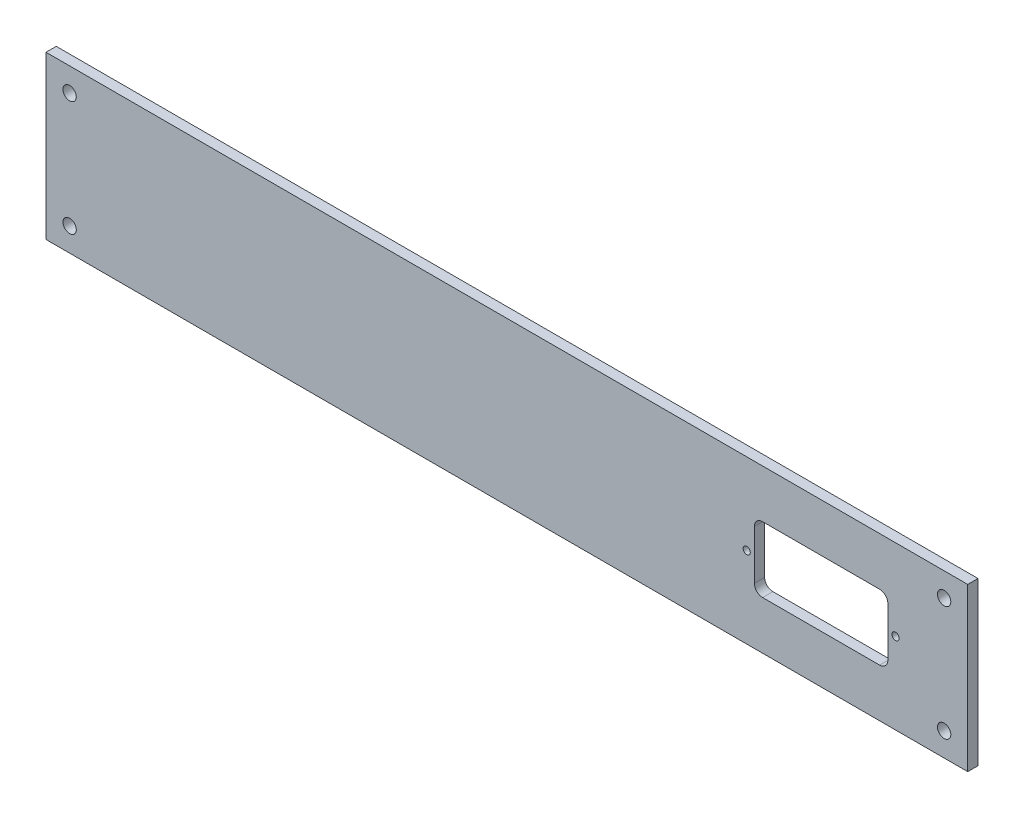
ISO-10303-21;
HEADER;
FILE_DESCRIPTION(('STEP AP214'),'2;1');
FILE_NAME('part.step','',(''),(''),'','','');
FILE_SCHEMA(('AUTOMOTIVE_DESIGN { 1 0 10303 214 1 1 1 1 }'));
ENDSEC;
DATA;
#1=APPLICATION_CONTEXT('core data for automotive mechanical design processes');
#2=APPLICATION_PROTOCOL_DEFINITION('international standard','automotive_design',2000,#1);
#3=PRODUCT_CONTEXT('',#1,'mechanical');
#4=PRODUCT('Part','Part','',(#3));
#5=PRODUCT_RELATED_PRODUCT_CATEGORY('part','',(#4));
#6=PRODUCT_DEFINITION_FORMATION('','',#4);
#7=PRODUCT_DEFINITION_CONTEXT('part definition',#1,'design');
#8=PRODUCT_DEFINITION('design','',#6,#7);
#9=PRODUCT_DEFINITION_SHAPE('','',#8);
#10=(LENGTH_UNIT() NAMED_UNIT(*) SI_UNIT(.MILLI.,.METRE.));
#11=(NAMED_UNIT(*) PLANE_ANGLE_UNIT() SI_UNIT($,.RADIAN.));
#12=(NAMED_UNIT(*) SI_UNIT($,.STERADIAN.) SOLID_ANGLE_UNIT());
#13=UNCERTAINTY_MEASURE_WITH_UNIT(LENGTH_MEASURE(1.E-05),#10,'distance_accuracy_value','');
#14=(GEOMETRIC_REPRESENTATION_CONTEXT(3) GLOBAL_UNCERTAINTY_ASSIGNED_CONTEXT((#13)) GLOBAL_UNIT_ASSIGNED_CONTEXT((#10,
#11,#12)) REPRESENTATION_CONTEXT('',''));
#15=CARTESIAN_POINT('',(0.,0.,0.));
#16=DIRECTION('',(0.,0.,1.));
#17=DIRECTION('',(1.,0.,0.));
#18=AXIS2_PLACEMENT_3D('',#15,#16,#17);
#19=CARTESIAN_POINT('',(0.,0.,5.));
#20=DIRECTION('',(0.,0.,-1.));
#21=DIRECTION('',(-1.,0.,0.));
#22=AXIS2_PLACEMENT_3D('',#19,#20,#21);
#23=PLANE('',#22);
#24=CARTESIAN_POINT('',(413.824633799864,39.5055064167184,5.));
#25=DIRECTION('',(0.,0.,-1.));
#26=DIRECTION('',(-1.,0.,0.));
#27=AXIS2_PLACEMENT_3D('',#24,#25,#26);
#28=CIRCLE('',#27,1.74999999999998);
#29=CARTESIAN_POINT('',(412.074633799864,39.5055064167184,5.));
#30=VERTEX_POINT('',#29);
#31=EDGE_CURVE('E181',#30,#30,#28,.T.);
#32=ORIENTED_EDGE('',*,*,#31,.T.);
#33=EDGE_LOOP('',(#32));
#34=FACE_BOUND('',#33,.T.);
#35=DIRECTION('',(0.,1.,0.));
#36=VECTOR('',#35,1.);
#37=CARTESIAN_POINT('',(345.074633799864,51.5,5.));
#38=LINE('',#37,#36);
#39=CARTESIAN_POINT('',(345.074633799864,27.5,5.));
#40=VERTEX_POINT('',#39);
#41=CARTESIAN_POINT('',(345.074633799864,51.5,5.));
#42=VERTEX_POINT('',#41);
#43=EDGE_CURVE('E144',#40,#42,#38,.T.);
#44=ORIENTED_EDGE('',*,*,#43,.T.);
#45=CARTESIAN_POINT('',(349.074633799864,51.5,5.));
#46=DIRECTION('',(0.,0.,-1.));
#47=DIRECTION('',(-1.,0.,0.));
#48=AXIS2_PLACEMENT_3D('',#45,#46,#47);
#49=CIRCLE('',#48,4.);
#50=CARTESIAN_POINT('',(349.074633799864,55.5,5.));
#51=VERTEX_POINT('',#50);
#52=EDGE_CURVE('E138',#42,#51,#49,.T.);
#53=ORIENTED_EDGE('',*,*,#52,.T.);
#54=DIRECTION('',(1.,0.,0.));
#55=VECTOR('',#54,1.);
#56=CARTESIAN_POINT('',(349.074633799864,55.5,5.));
#57=LINE('',#56,#55);
#58=CARTESIAN_POINT('',(406.074633799864,55.5,5.));
#59=VERTEX_POINT('',#58);
#60=EDGE_CURVE('E147',#51,#59,#57,.T.);
#61=ORIENTED_EDGE('',*,*,#60,.T.);
#62=CARTESIAN_POINT('',(406.074633799864,51.4999999999999,5.));
#63=DIRECTION('',(0.,0.,-1.));
#64=DIRECTION('',(1.,0.,0.));
#65=AXIS2_PLACEMENT_3D('',#62,#63,#64);
#66=CIRCLE('',#65,4.00000000000001);
#67=CARTESIAN_POINT('',(410.074633799864,51.4999999999999,5.));
#68=VERTEX_POINT('',#67);
#69=EDGE_CURVE('E60',#59,#68,#66,.T.);
#70=ORIENTED_EDGE('',*,*,#69,.T.);
#71=DIRECTION('',(0.,-1.,0.));
#72=VECTOR('',#71,1.);
#73=CARTESIAN_POINT('',(410.074633799864,51.4999999999999,5.));
#74=LINE('',#73,#72);
#75=CARTESIAN_POINT('',(410.074633799864,27.4999999999999,5.));
#76=VERTEX_POINT('',#75);
#77=EDGE_CURVE('E166',#68,#76,#74,.T.);
#78=ORIENTED_EDGE('',*,*,#77,.T.);
#79=CARTESIAN_POINT('',(406.074633799864,27.4999999999999,5.));
#80=DIRECTION('',(0.,0.,-1.));
#81=DIRECTION('',(1.,0.,0.));
#82=AXIS2_PLACEMENT_3D('',#79,#80,#81);
#83=CIRCLE('',#82,3.99999999999999);
#84=CARTESIAN_POINT('',(406.074633799864,23.5,5.));
#85=VERTEX_POINT('',#84);
#86=EDGE_CURVE('E169',#76,#85,#83,.T.);
#87=ORIENTED_EDGE('',*,*,#86,.T.);
#88=DIRECTION('',(-1.,0.,0.));
#89=VECTOR('',#88,1.);
#90=CARTESIAN_POINT('',(349.074633799864,23.5,5.));
#91=LINE('',#90,#89);
#92=CARTESIAN_POINT('',(349.074633799864,23.5,5.));
#93=VERTEX_POINT('',#92);
#94=EDGE_CURVE('E172',#85,#93,#91,.T.);
#95=ORIENTED_EDGE('',*,*,#94,.T.);
#96=CARTESIAN_POINT('',(349.074633799864,27.5,5.));
#97=DIRECTION('',(0.,0.,-1.));
#98=DIRECTION('',(1.,0.,0.));
#99=AXIS2_PLACEMENT_3D('',#96,#97,#98);
#100=CIRCLE('',#99,4.);
#101=EDGE_CURVE('E175',#93,#40,#100,.T.);
#102=ORIENTED_EDGE('',*,*,#101,.T.);
#103=EDGE_LOOP('',(#44,#53,#61,#70,#78,#87,#95,#102));
#104=FACE_BOUND('',#103,.T.);
#105=CARTESIAN_POINT('',(341.324633799864,39.5055064167184,5.));
#106=DIRECTION('',(0.,0.,-1.));
#107=DIRECTION('',(1.,0.,0.));
#108=AXIS2_PLACEMENT_3D('',#105,#106,#107);
#109=CIRCLE('',#108,1.74999999999998);
#110=CARTESIAN_POINT('',(343.074633799864,39.5055064167184,5.));
#111=VERTEX_POINT('',#110);
#112=EDGE_CURVE('E222',#111,#111,#109,.T.);
#113=ORIENTED_EDGE('',*,*,#112,.T.);
#114=EDGE_LOOP('',(#113));
#115=FACE_BOUND('',#114,.T.);
#116=DIRECTION('',(1.,0.,0.));
#117=VECTOR('',#116,1.);
#118=CARTESIAN_POINT('',(449.,0.,5.));
#119=LINE('',#118,#117);
#120=CARTESIAN_POINT('',(0.,0.,5.));
#121=VERTEX_POINT('',#120);
#122=CARTESIAN_POINT('',(449.,0.,5.));
#123=VERTEX_POINT('',#122);
#124=EDGE_CURVE('E235',#121,#123,#119,.T.);
#125=ORIENTED_EDGE('',*,*,#124,.T.);
#126=DIRECTION('',(0.,1.,0.));
#127=VECTOR('',#126,1.);
#128=CARTESIAN_POINT('',(449.,79.,5.));
#129=LINE('',#128,#127);
#130=CARTESIAN_POINT('',(449.,79.,5.));
#131=VERTEX_POINT('',#130);
#132=EDGE_CURVE('E403',#123,#131,#129,.T.);
#133=ORIENTED_EDGE('',*,*,#132,.T.);
#134=DIRECTION('',(-1.,0.,0.));
#135=VECTOR('',#134,1.);
#136=CARTESIAN_POINT('',(0.,79.,5.));
#137=LINE('',#136,#135);
#138=CARTESIAN_POINT('',(0.,79.,5.));
#139=VERTEX_POINT('',#138);
#140=EDGE_CURVE('E384',#131,#139,#137,.T.);
#141=ORIENTED_EDGE('',*,*,#140,.T.);
#142=DIRECTION('',(0.,-1.,0.));
#143=VECTOR('',#142,1.);
#144=CARTESIAN_POINT('',(0.,0.,5.));
#145=LINE('',#144,#143);
#146=EDGE_CURVE('E396',#139,#121,#145,.T.);
#147=ORIENTED_EDGE('',*,*,#146,.T.);
#148=EDGE_LOOP('',(#125,#133,#141,#147));
#149=FACE_BOUND('',#148,.T.);
#150=CARTESIAN_POINT('',(11.5,67.5,5.));
#151=DIRECTION('',(0.,0.,1.));
#152=DIRECTION('',(1.,0.,0.));
#153=AXIS2_PLACEMENT_3D('',#150,#151,#152);
#154=CIRCLE('',#153,3.25);
#155=CARTESIAN_POINT('',(14.75,67.5,5.));
#156=VERTEX_POINT('',#155);
#157=EDGE_CURVE('E206',#156,#156,#154,.T.);
#158=ORIENTED_EDGE('',*,*,#157,.F.);
#159=EDGE_LOOP('',(#158));
#160=FACE_BOUND('',#159,.T.);
#161=CARTESIAN_POINT('',(437.5,67.5,5.));
#162=DIRECTION('',(0.,0.,1.));
#163=DIRECTION('',(-1.,0.,0.));
#164=AXIS2_PLACEMENT_3D('',#161,#162,#163);
#165=CIRCLE('',#164,3.24999999999995);
#166=CARTESIAN_POINT('',(434.25,67.5,5.));
#167=VERTEX_POINT('',#166);
#168=EDGE_CURVE('E203',#167,#167,#165,.T.);
#169=ORIENTED_EDGE('',*,*,#168,.F.);
#170=EDGE_LOOP('',(#169));
#171=FACE_BOUND('',#170,.T.);
#172=CARTESIAN_POINT('',(11.5,11.5,5.));
#173=DIRECTION('',(0.,0.,1.));
#174=DIRECTION('',(-1.,0.,0.));
#175=AXIS2_PLACEMENT_3D('',#172,#173,#174);
#176=CIRCLE('',#175,3.25);
#177=CARTESIAN_POINT('',(8.25,11.5,5.));
#178=VERTEX_POINT('',#177);
#179=EDGE_CURVE('E204',#178,#178,#176,.T.);
#180=ORIENTED_EDGE('',*,*,#179,.F.);
#181=EDGE_LOOP('',(#180));
#182=FACE_BOUND('',#181,.T.);
#183=CARTESIAN_POINT('',(437.5,11.5,5.));
#184=DIRECTION('',(0.,0.,1.));
#185=DIRECTION('',(1.,0.,0.));
#186=AXIS2_PLACEMENT_3D('',#183,#184,#185);
#187=CIRCLE('',#186,3.24999999999995);
#188=CARTESIAN_POINT('',(440.75,11.5,5.));
#189=VERTEX_POINT('',#188);
#190=EDGE_CURVE('E221',#189,#189,#187,.T.);
#191=ORIENTED_EDGE('',*,*,#190,.F.);
#192=EDGE_LOOP('',(#191));
#193=FACE_BOUND('',#192,.T.);
#194=ADVANCED_FACE('F45',(#34,#104,#115,#149,#160,#171,#182,#193),#23,.F.);
#195=CARTESIAN_POINT('',(0.,0.,0.));
#196=DIRECTION('',(0.,0.,-1.));
#197=DIRECTION('',(-1.,0.,0.));
#198=AXIS2_PLACEMENT_3D('',#195,#196,#197);
#199=PLANE('',#198);
#200=CARTESIAN_POINT('',(413.824633799864,39.5055064167184,0.));
#201=DIRECTION('',(0.,0.,-1.));
#202=DIRECTION('',(-1.,0.,0.));
#203=AXIS2_PLACEMENT_3D('',#200,#201,#202);
#204=CIRCLE('',#203,1.74999999999998);
#205=CARTESIAN_POINT('',(412.074633799864,39.5055064167184,0.));
#206=VERTEX_POINT('',#205);
#207=EDGE_CURVE('E161',#206,#206,#204,.T.);
#208=ORIENTED_EDGE('',*,*,#207,.F.);
#209=EDGE_LOOP('',(#208));
#210=FACE_BOUND('',#209,.T.);
#211=CARTESIAN_POINT('',(349.074633799864,51.5,0.));
#212=DIRECTION('',(0.,0.,-1.));
#213=DIRECTION('',(-1.,0.,0.));
#214=AXIS2_PLACEMENT_3D('',#211,#212,#213);
#215=CIRCLE('',#214,4.);
#216=CARTESIAN_POINT('',(345.074633799864,51.5,0.));
#217=VERTEX_POINT('',#216);
#218=CARTESIAN_POINT('',(349.074633799864,55.5,0.));
#219=VERTEX_POINT('',#218);
#220=EDGE_CURVE('E68',#217,#219,#215,.T.);
#221=ORIENTED_EDGE('',*,*,#220,.F.);
#222=DIRECTION('',(0.,1.,0.));
#223=VECTOR('',#222,1.);
#224=CARTESIAN_POINT('',(345.074633799864,51.5,0.));
#225=LINE('',#224,#223);
#226=CARTESIAN_POINT('',(345.074633799864,27.5,0.));
#227=VERTEX_POINT('',#226);
#228=EDGE_CURVE('E154',#227,#217,#225,.T.);
#229=ORIENTED_EDGE('',*,*,#228,.F.);
#230=CARTESIAN_POINT('',(349.074633799864,27.5,0.));
#231=DIRECTION('',(0.,0.,-1.));
#232=DIRECTION('',(1.,0.,0.));
#233=AXIS2_PLACEMENT_3D('',#230,#231,#232);
#234=CIRCLE('',#233,4.);
#235=CARTESIAN_POINT('',(349.074633799864,23.5,0.));
#236=VERTEX_POINT('',#235);
#237=EDGE_CURVE('E158',#236,#227,#234,.T.);
#238=ORIENTED_EDGE('',*,*,#237,.F.);
#239=DIRECTION('',(-1.,0.,0.));
#240=VECTOR('',#239,1.);
#241=CARTESIAN_POINT('',(349.074633799864,23.5,0.));
#242=LINE('',#241,#240);
#243=CARTESIAN_POINT('',(406.074633799864,23.5,0.));
#244=VERTEX_POINT('',#243);
#245=EDGE_CURVE('E284',#244,#236,#242,.T.);
#246=ORIENTED_EDGE('',*,*,#245,.F.);
#247=CARTESIAN_POINT('',(406.074633799864,27.4999999999999,0.));
#248=DIRECTION('',(0.,0.,-1.));
#249=DIRECTION('',(1.,0.,0.));
#250=AXIS2_PLACEMENT_3D('',#247,#248,#249);
#251=CIRCLE('',#250,3.99999999999999);
#252=CARTESIAN_POINT('',(410.074633799864,27.4999999999999,0.));
#253=VERTEX_POINT('',#252);
#254=EDGE_CURVE('E280',#253,#244,#251,.T.);
#255=ORIENTED_EDGE('',*,*,#254,.F.);
#256=DIRECTION('',(0.,-1.,0.));
#257=VECTOR('',#256,1.);
#258=CARTESIAN_POINT('',(410.074633799864,51.4999999999999,0.));
#259=LINE('',#258,#257);
#260=CARTESIAN_POINT('',(410.074633799864,51.4999999999999,0.));
#261=VERTEX_POINT('',#260);
#262=EDGE_CURVE('E270',#261,#253,#259,.T.);
#263=ORIENTED_EDGE('',*,*,#262,.F.);
#264=CARTESIAN_POINT('',(406.074633799864,51.4999999999999,0.));
#265=DIRECTION('',(0.,0.,-1.));
#266=DIRECTION('',(1.,0.,0.));
#267=AXIS2_PLACEMENT_3D('',#264,#265,#266);
#268=CIRCLE('',#267,4.00000000000001);
#269=CARTESIAN_POINT('',(406.074633799864,55.5,0.));
#270=VERTEX_POINT('',#269);
#271=EDGE_CURVE('E266',#270,#261,#268,.T.);
#272=ORIENTED_EDGE('',*,*,#271,.F.);
#273=DIRECTION('',(1.,0.,0.));
#274=VECTOR('',#273,1.);
#275=CARTESIAN_POINT('',(349.074633799864,55.5,0.));
#276=LINE('',#275,#274);
#277=EDGE_CURVE('E180',#219,#270,#276,.T.);
#278=ORIENTED_EDGE('',*,*,#277,.F.);
#279=EDGE_LOOP('',(#221,#229,#238,#246,#255,#263,#272,#278));
#280=FACE_BOUND('',#279,.T.);
#281=CARTESIAN_POINT('',(341.324633799864,39.5055064167184,0.));
#282=DIRECTION('',(0.,0.,-1.));
#283=DIRECTION('',(1.,0.,0.));
#284=AXIS2_PLACEMENT_3D('',#281,#282,#283);
#285=CIRCLE('',#284,1.74999999999998);
#286=CARTESIAN_POINT('',(343.074633799864,39.5055064167184,0.));
#287=VERTEX_POINT('',#286);
#288=EDGE_CURVE('E253',#287,#287,#285,.T.);
#289=ORIENTED_EDGE('',*,*,#288,.F.);
#290=EDGE_LOOP('',(#289));
#291=FACE_BOUND('',#290,.T.);
#292=CARTESIAN_POINT('',(11.5,11.5,0.));
#293=DIRECTION('',(0.,0.,1.));
#294=DIRECTION('',(-1.,0.,0.));
#295=AXIS2_PLACEMENT_3D('',#292,#293,#294);
#296=CIRCLE('',#295,3.25);
#297=CARTESIAN_POINT('',(8.25,11.5,0.));
#298=VERTEX_POINT('',#297);
#299=EDGE_CURVE('E243',#298,#298,#296,.T.);
#300=ORIENTED_EDGE('',*,*,#299,.T.);
#301=EDGE_LOOP('',(#300));
#302=FACE_BOUND('',#301,.T.);
#303=CARTESIAN_POINT('',(11.5,67.5,0.));
#304=DIRECTION('',(0.,0.,1.));
#305=DIRECTION('',(1.,0.,0.));
#306=AXIS2_PLACEMENT_3D('',#303,#304,#305);
#307=CIRCLE('',#306,3.25);
#308=CARTESIAN_POINT('',(14.75,67.5,0.));
#309=VERTEX_POINT('',#308);
#310=EDGE_CURVE('E230',#309,#309,#307,.T.);
#311=ORIENTED_EDGE('',*,*,#310,.T.);
#312=EDGE_LOOP('',(#311));
#313=FACE_BOUND('',#312,.T.);
#314=DIRECTION('',(1.,0.,0.));
#315=VECTOR('',#314,1.);
#316=CARTESIAN_POINT('',(449.,0.,0.));
#317=LINE('',#316,#315);
#318=CARTESIAN_POINT('',(0.,0.,0.));
#319=VERTEX_POINT('',#318);
#320=CARTESIAN_POINT('',(449.,0.,0.));
#321=VERTEX_POINT('',#320);
#322=EDGE_CURVE('E380',#319,#321,#317,.T.);
#323=ORIENTED_EDGE('',*,*,#322,.F.);
#324=DIRECTION('',(0.,-1.,0.));
#325=VECTOR('',#324,1.);
#326=CARTESIAN_POINT('',(0.,0.,0.));
#327=LINE('',#326,#325);
#328=CARTESIAN_POINT('',(0.,79.,0.));
#329=VERTEX_POINT('',#328);
#330=EDGE_CURVE('E388',#329,#319,#327,.T.);
#331=ORIENTED_EDGE('',*,*,#330,.F.);
#332=DIRECTION('',(-1.,0.,0.));
#333=VECTOR('',#332,1.);
#334=CARTESIAN_POINT('',(0.,79.,0.));
#335=LINE('',#334,#333);
#336=CARTESIAN_POINT('',(449.,79.,0.));
#337=VERTEX_POINT('',#336);
#338=EDGE_CURVE('E379',#337,#329,#335,.T.);
#339=ORIENTED_EDGE('',*,*,#338,.F.);
#340=DIRECTION('',(0.,1.,0.));
#341=VECTOR('',#340,1.);
#342=CARTESIAN_POINT('',(449.,79.,0.));
#343=LINE('',#342,#341);
#344=EDGE_CURVE('E371',#321,#337,#343,.T.);
#345=ORIENTED_EDGE('',*,*,#344,.F.);
#346=EDGE_LOOP('',(#323,#331,#339,#345));
#347=FACE_BOUND('',#346,.T.);
#348=CARTESIAN_POINT('',(437.5,67.5,0.));
#349=DIRECTION('',(0.,0.,1.));
#350=DIRECTION('',(-1.,0.,0.));
#351=AXIS2_PLACEMENT_3D('',#348,#349,#350);
#352=CIRCLE('',#351,3.24999999999995);
#353=CARTESIAN_POINT('',(434.25,67.5,0.));
#354=VERTEX_POINT('',#353);
#355=EDGE_CURVE('E197',#354,#354,#352,.T.);
#356=ORIENTED_EDGE('',*,*,#355,.T.);
#357=EDGE_LOOP('',(#356));
#358=FACE_BOUND('',#357,.T.);
#359=CARTESIAN_POINT('',(437.5,11.5,0.));
#360=DIRECTION('',(0.,0.,1.));
#361=DIRECTION('',(1.,0.,0.));
#362=AXIS2_PLACEMENT_3D('',#359,#360,#361);
#363=CIRCLE('',#362,3.24999999999995);
#364=CARTESIAN_POINT('',(440.75,11.5,0.));
#365=VERTEX_POINT('',#364);
#366=EDGE_CURVE('E215',#365,#365,#363,.T.);
#367=ORIENTED_EDGE('',*,*,#366,.T.);
#368=EDGE_LOOP('',(#367));
#369=FACE_BOUND('',#368,.T.);
#370=ADVANCED_FACE('F320',(#210,#280,#291,#302,#313,#347,#358,#369),#199,.T.);
#371=CARTESIAN_POINT('',(449.,0.,5.));
#372=DIRECTION('',(0.,1.,0.));
#373=DIRECTION('',(-1.,0.,0.));
#374=AXIS2_PLACEMENT_3D('',#371,#372,#373);
#375=PLANE('',#374);
#376=ORIENTED_EDGE('',*,*,#322,.T.);
#377=DIRECTION('',(0.,0.,-1.));
#378=VECTOR('',#377,1.);
#379=CARTESIAN_POINT('',(449.,0.,5.));
#380=LINE('',#379,#378);
#381=EDGE_CURVE('E12',#123,#321,#380,.T.);
#382=ORIENTED_EDGE('',*,*,#381,.F.);
#383=ORIENTED_EDGE('',*,*,#124,.F.);
#384=DIRECTION('',(0.,0.,-1.));
#385=VECTOR('',#384,1.);
#386=CARTESIAN_POINT('',(0.,0.,5.));
#387=LINE('',#386,#385);
#388=EDGE_CURVE('E393',#121,#319,#387,.T.);
#389=ORIENTED_EDGE('',*,*,#388,.T.);
#390=EDGE_LOOP('',(#376,#382,#383,#389));
#391=FACE_BOUND('',#390,.T.);
#392=ADVANCED_FACE('F47',(#391),#375,.F.);
#393=CARTESIAN_POINT('',(449.,79.,5.));
#394=DIRECTION('',(-1.,0.,0.));
#395=DIRECTION('',(0.,0.,1.));
#396=AXIS2_PLACEMENT_3D('',#393,#394,#395);
#397=PLANE('',#396);
#398=ORIENTED_EDGE('',*,*,#344,.T.);
#399=DIRECTION('',(0.,0.,-1.));
#400=VECTOR('',#399,1.);
#401=CARTESIAN_POINT('',(449.,79.,5.));
#402=LINE('',#401,#400);
#403=EDGE_CURVE('E53',#131,#337,#402,.T.);
#404=ORIENTED_EDGE('',*,*,#403,.F.);
#405=ORIENTED_EDGE('',*,*,#132,.F.);
#406=ORIENTED_EDGE('',*,*,#381,.T.);
#407=EDGE_LOOP('',(#398,#404,#405,#406));
#408=FACE_BOUND('',#407,.T.);
#409=ADVANCED_FACE('F362',(#408),#397,.F.);
#410=CARTESIAN_POINT('',(0.,79.,5.));
#411=DIRECTION('',(0.,-1.,0.));
#412=DIRECTION('',(0.,0.,-1.));
#413=AXIS2_PLACEMENT_3D('',#410,#411,#412);
#414=PLANE('',#413);
#415=ORIENTED_EDGE('',*,*,#338,.T.);
#416=DIRECTION('',(0.,0.,-1.));
#417=VECTOR('',#416,1.);
#418=CARTESIAN_POINT('',(0.,79.,5.));
#419=LINE('',#418,#417);
#420=EDGE_CURVE('E385',#139,#329,#419,.T.);
#421=ORIENTED_EDGE('',*,*,#420,.F.);
#422=ORIENTED_EDGE('',*,*,#140,.F.);
#423=ORIENTED_EDGE('',*,*,#403,.T.);
#424=EDGE_LOOP('',(#415,#421,#422,#423));
#425=FACE_BOUND('',#424,.T.);
#426=ADVANCED_FACE('F359',(#425),#414,.F.);
#427=CARTESIAN_POINT('',(0.,0.,5.));
#428=DIRECTION('',(1.,0.,0.));
#429=DIRECTION('',(0.,1.,0.));
#430=AXIS2_PLACEMENT_3D('',#427,#428,#429);
#431=PLANE('',#430);
#432=ORIENTED_EDGE('',*,*,#330,.T.);
#433=ORIENTED_EDGE('',*,*,#388,.F.);
#434=ORIENTED_EDGE('',*,*,#146,.F.);
#435=ORIENTED_EDGE('',*,*,#420,.T.);
#436=EDGE_LOOP('',(#432,#433,#434,#435));
#437=FACE_BOUND('',#436,.T.);
#438=ADVANCED_FACE('F356',(#437),#431,.F.);
#439=CARTESIAN_POINT('',(11.5,67.5,5.));
#440=DIRECTION('',(0.,0.,-1.));
#441=DIRECTION('',(-1.,0.,0.));
#442=AXIS2_PLACEMENT_3D('',#439,#440,#441);
#443=CYLINDRICAL_SURFACE('',#442,3.25);
#444=ORIENTED_EDGE('',*,*,#157,.T.);
#445=EDGE_LOOP('',(#444));
#446=FACE_BOUND('',#445,.T.);
#447=ORIENTED_EDGE('',*,*,#310,.F.);
#448=EDGE_LOOP('',(#447));
#449=FACE_BOUND('',#448,.T.);
#450=ADVANCED_FACE('F353',(#446,#449),#443,.F.);
#451=CARTESIAN_POINT('',(437.5,67.5,5.));
#452=DIRECTION('',(0.,0.,-1.));
#453=DIRECTION('',(-1.,0.,0.));
#454=AXIS2_PLACEMENT_3D('',#451,#452,#453);
#455=CYLINDRICAL_SURFACE('',#454,3.24999999999995);
#456=ORIENTED_EDGE('',*,*,#168,.T.);
#457=EDGE_LOOP('',(#456));
#458=FACE_BOUND('',#457,.T.);
#459=ORIENTED_EDGE('',*,*,#355,.F.);
#460=EDGE_LOOP('',(#459));
#461=FACE_BOUND('',#460,.T.);
#462=ADVANCED_FACE('F434',(#458,#461),#455,.F.);
#463=CARTESIAN_POINT('',(11.5,11.5,5.));
#464=DIRECTION('',(0.,0.,-1.));
#465=DIRECTION('',(-1.,0.,0.));
#466=AXIS2_PLACEMENT_3D('',#463,#464,#465);
#467=CYLINDRICAL_SURFACE('',#466,3.25);
#468=ORIENTED_EDGE('',*,*,#179,.T.);
#469=EDGE_LOOP('',(#468));
#470=FACE_BOUND('',#469,.T.);
#471=ORIENTED_EDGE('',*,*,#299,.F.);
#472=EDGE_LOOP('',(#471));
#473=FACE_BOUND('',#472,.T.);
#474=ADVANCED_FACE('F424',(#470,#473),#467,.F.);
#475=CARTESIAN_POINT('',(437.5,11.5,5.));
#476=DIRECTION('',(0.,0.,-1.));
#477=DIRECTION('',(-1.,0.,0.));
#478=AXIS2_PLACEMENT_3D('',#475,#476,#477);
#479=CYLINDRICAL_SURFACE('',#478,3.24999999999995);
#480=ORIENTED_EDGE('',*,*,#190,.T.);
#481=EDGE_LOOP('',(#480));
#482=FACE_BOUND('',#481,.T.);
#483=ORIENTED_EDGE('',*,*,#366,.F.);
#484=EDGE_LOOP('',(#483));
#485=FACE_BOUND('',#484,.T.);
#486=ADVANCED_FACE('F420',(#482,#485),#479,.F.);
#487=CARTESIAN_POINT('',(341.324633799864,39.5055064167184,5.));
#488=DIRECTION('',(0.,0.,-1.));
#489=DIRECTION('',(-1.,0.,0.));
#490=AXIS2_PLACEMENT_3D('',#487,#488,#489);
#491=CYLINDRICAL_SURFACE('',#490,1.74999999999998);
#492=ORIENTED_EDGE('',*,*,#112,.F.);
#493=EDGE_LOOP('',(#492));
#494=FACE_BOUND('',#493,.T.);
#495=ORIENTED_EDGE('',*,*,#288,.T.);
#496=EDGE_LOOP('',(#495));
#497=FACE_BOUND('',#496,.T.);
#498=ADVANCED_FACE('F423',(#494,#497),#491,.F.);
#499=CARTESIAN_POINT('',(349.074633799864,51.5,5.));
#500=DIRECTION('',(0.,0.,-1.));
#501=DIRECTION('',(-1.,0.,0.));
#502=AXIS2_PLACEMENT_3D('',#499,#500,#501);
#503=CYLINDRICAL_SURFACE('',#502,4.);
#504=ORIENTED_EDGE('',*,*,#220,.T.);
#505=DIRECTION('',(0.,0.,-1.));
#506=VECTOR('',#505,1.);
#507=CARTESIAN_POINT('',(349.074633799864,55.5,5.));
#508=LINE('',#507,#506);
#509=EDGE_CURVE('E134',#51,#219,#508,.T.);
#510=ORIENTED_EDGE('',*,*,#509,.F.);
#511=ORIENTED_EDGE('',*,*,#52,.F.);
#512=DIRECTION('',(0.,0.,-1.));
#513=VECTOR('',#512,1.);
#514=CARTESIAN_POINT('',(345.074633799864,51.5,5.));
#515=LINE('',#514,#513);
#516=EDGE_CURVE('E258',#42,#217,#515,.T.);
#517=ORIENTED_EDGE('',*,*,#516,.T.);
#518=EDGE_LOOP('',(#504,#510,#511,#517));
#519=FACE_BOUND('',#518,.T.);
#520=ADVANCED_FACE('F136',(#519),#503,.F.);
#521=CARTESIAN_POINT('',(345.074633799864,51.5,5.));
#522=DIRECTION('',(-1.,0.,0.));
#523=DIRECTION('',(0.,0.,1.));
#524=AXIS2_PLACEMENT_3D('',#521,#522,#523);
#525=PLANE('',#524);
#526=ORIENTED_EDGE('',*,*,#228,.T.);
#527=ORIENTED_EDGE('',*,*,#516,.F.);
#528=ORIENTED_EDGE('',*,*,#43,.F.);
#529=DIRECTION('',(0.,0.,-1.));
#530=VECTOR('',#529,1.);
#531=CARTESIAN_POINT('',(345.074633799864,27.5,5.));
#532=LINE('',#531,#530);
#533=EDGE_CURVE('E305',#40,#227,#532,.T.);
#534=ORIENTED_EDGE('',*,*,#533,.T.);
#535=EDGE_LOOP('',(#526,#527,#528,#534));
#536=FACE_BOUND('',#535,.T.);
#537=ADVANCED_FACE('F491',(#536),#525,.F.);
#538=CARTESIAN_POINT('',(349.074633799864,27.5,5.));
#539=DIRECTION('',(0.,0.,-1.));
#540=DIRECTION('',(-1.,0.,0.));
#541=AXIS2_PLACEMENT_3D('',#538,#539,#540);
#542=CYLINDRICAL_SURFACE('',#541,4.);
#543=ORIENTED_EDGE('',*,*,#237,.T.);
#544=ORIENTED_EDGE('',*,*,#533,.F.);
#545=ORIENTED_EDGE('',*,*,#101,.F.);
#546=DIRECTION('',(0.,0.,-1.));
#547=VECTOR('',#546,1.);
#548=CARTESIAN_POINT('',(349.074633799864,23.5,5.));
#549=LINE('',#548,#547);
#550=EDGE_CURVE('E307',#93,#236,#549,.T.);
#551=ORIENTED_EDGE('',*,*,#550,.T.);
#552=EDGE_LOOP('',(#543,#544,#545,#551));
#553=FACE_BOUND('',#552,.T.);
#554=ADVANCED_FACE('F499',(#553),#542,.F.);
#555=CARTESIAN_POINT('',(349.074633799864,23.5,5.));
#556=DIRECTION('',(0.,-1.,0.));
#557=DIRECTION('',(0.,0.,-1.));
#558=AXIS2_PLACEMENT_3D('',#555,#556,#557);
#559=PLANE('',#558);
#560=ORIENTED_EDGE('',*,*,#245,.T.);
#561=ORIENTED_EDGE('',*,*,#550,.F.);
#562=ORIENTED_EDGE('',*,*,#94,.F.);
#563=DIRECTION('',(0.,0.,-1.));
#564=VECTOR('',#563,1.);
#565=CARTESIAN_POINT('',(406.074633799864,23.5,5.));
#566=LINE('',#565,#564);
#567=EDGE_CURVE('E309',#85,#244,#566,.T.);
#568=ORIENTED_EDGE('',*,*,#567,.T.);
#569=EDGE_LOOP('',(#560,#561,#562,#568));
#570=FACE_BOUND('',#569,.T.);
#571=ADVANCED_FACE('F508',(#570),#559,.F.);
#572=CARTESIAN_POINT('',(406.074633799864,27.4999999999999,5.));
#573=DIRECTION('',(0.,0.,-1.));
#574=DIRECTION('',(-1.,0.,0.));
#575=AXIS2_PLACEMENT_3D('',#572,#573,#574);
#576=CYLINDRICAL_SURFACE('',#575,3.99999999999999);
#577=ORIENTED_EDGE('',*,*,#254,.T.);
#578=ORIENTED_EDGE('',*,*,#567,.F.);
#579=ORIENTED_EDGE('',*,*,#86,.F.);
#580=DIRECTION('',(0.,0.,-1.));
#581=VECTOR('',#580,1.);
#582=CARTESIAN_POINT('',(410.074633799864,27.4999999999999,5.));
#583=LINE('',#582,#581);
#584=EDGE_CURVE('E311',#76,#253,#583,.T.);
#585=ORIENTED_EDGE('',*,*,#584,.T.);
#586=EDGE_LOOP('',(#577,#578,#579,#585));
#587=FACE_BOUND('',#586,.T.);
#588=ADVANCED_FACE('F518',(#587),#576,.F.);
#589=CARTESIAN_POINT('',(410.074633799864,51.4999999999999,5.));
#590=DIRECTION('',(1.,0.,0.));
#591=DIRECTION('',(0.,0.,-1.));
#592=AXIS2_PLACEMENT_3D('',#589,#590,#591);
#593=PLANE('',#592);
#594=ORIENTED_EDGE('',*,*,#262,.T.);
#595=ORIENTED_EDGE('',*,*,#584,.F.);
#596=ORIENTED_EDGE('',*,*,#77,.F.);
#597=DIRECTION('',(0.,0.,-1.));
#598=VECTOR('',#597,1.);
#599=CARTESIAN_POINT('',(410.074633799864,51.4999999999999,5.));
#600=LINE('',#599,#598);
#601=EDGE_CURVE('E313',#68,#261,#600,.T.);
#602=ORIENTED_EDGE('',*,*,#601,.T.);
#603=EDGE_LOOP('',(#594,#595,#596,#602));
#604=FACE_BOUND('',#603,.T.);
#605=ADVANCED_FACE('F528',(#604),#593,.F.);
#606=CARTESIAN_POINT('',(406.074633799864,51.4999999999999,5.));
#607=DIRECTION('',(0.,0.,-1.));
#608=DIRECTION('',(-1.,0.,0.));
#609=AXIS2_PLACEMENT_3D('',#606,#607,#608);
#610=CYLINDRICAL_SURFACE('',#609,4.00000000000001);
#611=ORIENTED_EDGE('',*,*,#271,.T.);
#612=ORIENTED_EDGE('',*,*,#601,.F.);
#613=ORIENTED_EDGE('',*,*,#69,.F.);
#614=DIRECTION('',(0.,0.,-1.));
#615=VECTOR('',#614,1.);
#616=CARTESIAN_POINT('',(406.074633799864,55.5,5.));
#617=LINE('',#616,#615);
#618=EDGE_CURVE('E143',#59,#270,#617,.T.);
#619=ORIENTED_EDGE('',*,*,#618,.T.);
#620=EDGE_LOOP('',(#611,#612,#613,#619));
#621=FACE_BOUND('',#620,.T.);
#622=ADVANCED_FACE('F315',(#621),#610,.F.);
#623=CARTESIAN_POINT('',(349.074633799864,55.5,5.));
#624=DIRECTION('',(0.,1.,0.));
#625=DIRECTION('',(-1.,0.,0.));
#626=AXIS2_PLACEMENT_3D('',#623,#624,#625);
#627=PLANE('',#626);
#628=ORIENTED_EDGE('',*,*,#277,.T.);
#629=ORIENTED_EDGE('',*,*,#618,.F.);
#630=ORIENTED_EDGE('',*,*,#60,.F.);
#631=ORIENTED_EDGE('',*,*,#509,.T.);
#632=EDGE_LOOP('',(#628,#629,#630,#631));
#633=FACE_BOUND('',#632,.T.);
#634=ADVANCED_FACE('F148',(#633),#627,.F.);
#635=CARTESIAN_POINT('',(413.824633799864,39.5055064167184,5.));
#636=DIRECTION('',(0.,0.,-1.));
#637=DIRECTION('',(-1.,0.,0.));
#638=AXIS2_PLACEMENT_3D('',#635,#636,#637);
#639=CYLINDRICAL_SURFACE('',#638,1.74999999999998);
#640=ORIENTED_EDGE('',*,*,#31,.F.);
#641=EDGE_LOOP('',(#640));
#642=FACE_BOUND('',#641,.T.);
#643=ORIENTED_EDGE('',*,*,#207,.T.);
#644=EDGE_LOOP('',(#643));
#645=FACE_BOUND('',#644,.T.);
#646=ADVANCED_FACE('F337',(#642,#645),#639,.F.);
#647=CLOSED_SHELL('',(#194,#370,#392,#409,#426,#438,#450,#462,#474,#486,#498,#520,#537,#554,
#571,#588,#605,#622,#634,#646));
#648=MANIFOLD_SOLID_BREP('B2',#647);
#649=ADVANCED_BREP_SHAPE_REPRESENTATION('',(#18,#648),#14);
#650=SHAPE_DEFINITION_REPRESENTATION(#9,#649);
ENDSEC;
END-ISO-10303-21;
